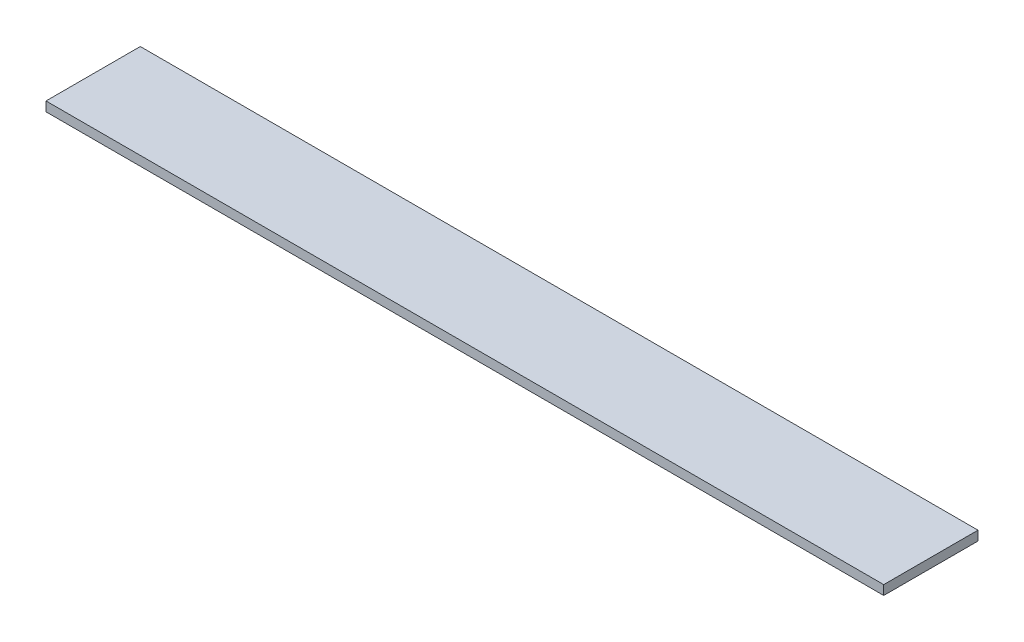
ISO-10303-21;
HEADER;
FILE_DESCRIPTION(('STEP AP214'),'2;1');
FILE_NAME('part.step','',(''),(''),'','','');
FILE_SCHEMA(('AUTOMOTIVE_DESIGN { 1 0 10303 214 1 1 1 1 }'));
ENDSEC;
DATA;
#1=APPLICATION_CONTEXT('core data for automotive mechanical design processes');
#2=APPLICATION_PROTOCOL_DEFINITION('international standard','automotive_design',2000,#1);
#3=PRODUCT_CONTEXT('',#1,'mechanical');
#4=PRODUCT('Part','Part','',(#3));
#5=PRODUCT_RELATED_PRODUCT_CATEGORY('part','',(#4));
#6=PRODUCT_DEFINITION_FORMATION('','',#4);
#7=PRODUCT_DEFINITION_CONTEXT('part definition',#1,'design');
#8=PRODUCT_DEFINITION('design','',#6,#7);
#9=PRODUCT_DEFINITION_SHAPE('','',#8);
#10=(LENGTH_UNIT() NAMED_UNIT(*) SI_UNIT(.MILLI.,.METRE.));
#11=(NAMED_UNIT(*) PLANE_ANGLE_UNIT() SI_UNIT($,.RADIAN.));
#12=(NAMED_UNIT(*) SI_UNIT($,.STERADIAN.) SOLID_ANGLE_UNIT());
#13=UNCERTAINTY_MEASURE_WITH_UNIT(LENGTH_MEASURE(1.E-05),#10,'distance_accuracy_value','');
#14=(GEOMETRIC_REPRESENTATION_CONTEXT(3) GLOBAL_UNCERTAINTY_ASSIGNED_CONTEXT((#13)) GLOBAL_UNIT_ASSIGNED_CONTEXT((#10,
#11,#12)) REPRESENTATION_CONTEXT('',''));
#15=CARTESIAN_POINT('',(0.,0.,0.));
#16=DIRECTION('',(0.,0.,1.));
#17=DIRECTION('',(1.,0.,0.));
#18=AXIS2_PLACEMENT_3D('',#15,#16,#17);
#19=CARTESIAN_POINT('',(-444.265,10.,-49.9999999999999));
#20=DIRECTION('',(1.,0.,0.));
#21=DIRECTION('',(0.,0.,-1.));
#22=AXIS2_PLACEMENT_3D('',#19,#20,#21);
#23=PLANE('',#22);
#24=DIRECTION('',(0.,0.,1.));
#25=VECTOR('',#24,1.);
#26=CARTESIAN_POINT('',(-444.265,0.,-49.9999999999999));
#27=LINE('',#26,#25);
#28=CARTESIAN_POINT('',(-444.265,0.,-49.9999999999999));
#29=VERTEX_POINT('',#28);
#30=CARTESIAN_POINT('',(-444.265,0.,50.0000000000002));
#31=VERTEX_POINT('',#30);
#32=EDGE_CURVE('E97',#29,#31,#27,.T.);
#33=ORIENTED_EDGE('',*,*,#32,.T.);
#34=DIRECTION('',(0.,-1.,0.));
#35=VECTOR('',#34,1.);
#36=CARTESIAN_POINT('',(-444.265,10.,50.0000000000002));
#37=LINE('',#36,#35);
#38=CARTESIAN_POINT('',(-444.265,10.,50.0000000000002));
#39=VERTEX_POINT('',#38);
#40=EDGE_CURVE('E11',#39,#31,#37,.T.);
#41=ORIENTED_EDGE('',*,*,#40,.F.);
#42=DIRECTION('',(0.,0.,1.));
#43=VECTOR('',#42,1.);
#44=CARTESIAN_POINT('',(-444.265,10.,-49.9999999999999));
#45=LINE('',#44,#43);
#46=CARTESIAN_POINT('',(-444.265,10.,-49.9999999999999));
#47=VERTEX_POINT('',#46);
#48=EDGE_CURVE('E85',#47,#39,#45,.T.);
#49=ORIENTED_EDGE('',*,*,#48,.F.);
#50=DIRECTION('',(0.,-1.,0.));
#51=VECTOR('',#50,1.);
#52=CARTESIAN_POINT('',(-444.265,10.,-49.9999999999999));
#53=LINE('',#52,#51);
#54=EDGE_CURVE('E93',#47,#29,#53,.T.);
#55=ORIENTED_EDGE('',*,*,#54,.T.);
#56=EDGE_LOOP('',(#33,#41,#49,#55));
#57=FACE_BOUND('',#56,.T.);
#58=ADVANCED_FACE('F34',(#57),#23,.F.);
#59=CARTESIAN_POINT('',(-444.265,10.,50.0000000000002));
#60=DIRECTION('',(0.,0.,-1.));
#61=DIRECTION('',(-1.,0.,0.));
#62=AXIS2_PLACEMENT_3D('',#59,#60,#61);
#63=PLANE('',#62);
#64=DIRECTION('',(1.,0.,0.));
#65=VECTOR('',#64,1.);
#66=CARTESIAN_POINT('',(-444.265,0.,50.0000000000002));
#67=LINE('',#66,#65);
#68=CARTESIAN_POINT('',(444.265,0.,50.0000000000001));
#69=VERTEX_POINT('',#68);
#70=EDGE_CURVE('E89',#31,#69,#67,.T.);
#71=ORIENTED_EDGE('',*,*,#70,.T.);
#72=DIRECTION('',(0.,-1.,0.));
#73=VECTOR('',#72,1.);
#74=CARTESIAN_POINT('',(444.265,10.,50.0000000000001));
#75=LINE('',#74,#73);
#76=CARTESIAN_POINT('',(444.265,10.,50.0000000000001));
#77=VERTEX_POINT('',#76);
#78=EDGE_CURVE('E42',#77,#69,#75,.T.);
#79=ORIENTED_EDGE('',*,*,#78,.F.);
#80=DIRECTION('',(1.,0.,0.));
#81=VECTOR('',#80,1.);
#82=CARTESIAN_POINT('',(-444.265,10.,50.0000000000002));
#83=LINE('',#82,#81);
#84=EDGE_CURVE('E80',#39,#77,#83,.T.);
#85=ORIENTED_EDGE('',*,*,#84,.F.);
#86=ORIENTED_EDGE('',*,*,#40,.T.);
#87=EDGE_LOOP('',(#71,#79,#85,#86));
#88=FACE_BOUND('',#87,.T.);
#89=ADVANCED_FACE('F88',(#88),#63,.F.);
#90=CARTESIAN_POINT('',(444.265,10.,-49.9999999999999));
#91=DIRECTION('',(-1.,0.,0.));
#92=DIRECTION('',(0.,0.,1.));
#93=AXIS2_PLACEMENT_3D('',#90,#91,#92);
#94=PLANE('',#93);
#95=DIRECTION('',(0.,0.,-1.));
#96=VECTOR('',#95,1.);
#97=CARTESIAN_POINT('',(444.265,0.,-49.9999999999999));
#98=LINE('',#97,#96);
#99=CARTESIAN_POINT('',(444.265,0.,-49.9999999999999));
#100=VERTEX_POINT('',#99);
#101=EDGE_CURVE('E67',#69,#100,#98,.T.);
#102=ORIENTED_EDGE('',*,*,#101,.T.);
#103=DIRECTION('',(0.,-1.,0.));
#104=VECTOR('',#103,1.);
#105=CARTESIAN_POINT('',(444.265,10.,-49.9999999999999));
#106=LINE('',#105,#104);
#107=CARTESIAN_POINT('',(444.265,10.,-49.9999999999999));
#108=VERTEX_POINT('',#107);
#109=EDGE_CURVE('E90',#108,#100,#106,.T.);
#110=ORIENTED_EDGE('',*,*,#109,.F.);
#111=DIRECTION('',(0.,0.,-1.));
#112=VECTOR('',#111,1.);
#113=CARTESIAN_POINT('',(444.265,10.,-49.9999999999999));
#114=LINE('',#113,#112);
#115=EDGE_CURVE('E83',#77,#108,#114,.T.);
#116=ORIENTED_EDGE('',*,*,#115,.F.);
#117=ORIENTED_EDGE('',*,*,#78,.T.);
#118=EDGE_LOOP('',(#102,#110,#116,#117));
#119=FACE_BOUND('',#118,.T.);
#120=ADVANCED_FACE('F91',(#119),#94,.F.);
#121=CARTESIAN_POINT('',(-444.265,10.,-49.9999999999999));
#122=DIRECTION('',(0.,0.,1.));
#123=DIRECTION('',(1.,0.,0.));
#124=AXIS2_PLACEMENT_3D('',#121,#122,#123);
#125=PLANE('',#124);
#126=DIRECTION('',(-1.,0.,0.));
#127=VECTOR('',#126,1.);
#128=CARTESIAN_POINT('',(-444.265,0.,-49.9999999999999));
#129=LINE('',#128,#127);
#130=EDGE_CURVE('E73',#100,#29,#129,.T.);
#131=ORIENTED_EDGE('',*,*,#130,.T.);
#132=ORIENTED_EDGE('',*,*,#54,.F.);
#133=DIRECTION('',(-1.,0.,0.));
#134=VECTOR('',#133,1.);
#135=CARTESIAN_POINT('',(-444.265,10.,-49.9999999999999));
#136=LINE('',#135,#134);
#137=EDGE_CURVE('E50',#108,#47,#136,.T.);
#138=ORIENTED_EDGE('',*,*,#137,.F.);
#139=ORIENTED_EDGE('',*,*,#109,.T.);
#140=EDGE_LOOP('',(#131,#132,#138,#139));
#141=FACE_BOUND('',#140,.T.);
#142=ADVANCED_FACE('F104',(#141),#125,.F.);
#143=CARTESIAN_POINT('',(0.,10.,0.));
#144=DIRECTION('',(0.,1.,0.));
#145=DIRECTION('',(0.,0.,1.));
#146=AXIS2_PLACEMENT_3D('',#143,#144,#145);
#147=PLANE('',#146);
#148=ORIENTED_EDGE('',*,*,#48,.T.);
#149=ORIENTED_EDGE('',*,*,#84,.T.);
#150=ORIENTED_EDGE('',*,*,#115,.T.);
#151=ORIENTED_EDGE('',*,*,#137,.T.);
#152=EDGE_LOOP('',(#148,#149,#150,#151));
#153=FACE_BOUND('',#152,.T.);
#154=ADVANCED_FACE('F81',(#153),#147,.T.);
#155=CARTESIAN_POINT('',(0.,0.,0.));
#156=DIRECTION('',(0.,1.,0.));
#157=DIRECTION('',(0.,0.,1.));
#158=AXIS2_PLACEMENT_3D('',#155,#156,#157);
#159=PLANE('',#158);
#160=ORIENTED_EDGE('',*,*,#32,.F.);
#161=ORIENTED_EDGE('',*,*,#130,.F.);
#162=ORIENTED_EDGE('',*,*,#101,.F.);
#163=ORIENTED_EDGE('',*,*,#70,.F.);
#164=EDGE_LOOP('',(#160,#161,#162,#163));
#165=FACE_BOUND('',#164,.T.);
#166=ADVANCED_FACE('F107',(#165),#159,.F.);
#167=CLOSED_SHELL('',(#58,#89,#120,#142,#154,#166));
#168=MANIFOLD_SOLID_BREP('B2',#167);
#169=ADVANCED_BREP_SHAPE_REPRESENTATION('',(#18,#168),#14);
#170=SHAPE_DEFINITION_REPRESENTATION(#9,#169);
ENDSEC;
END-ISO-10303-21;
